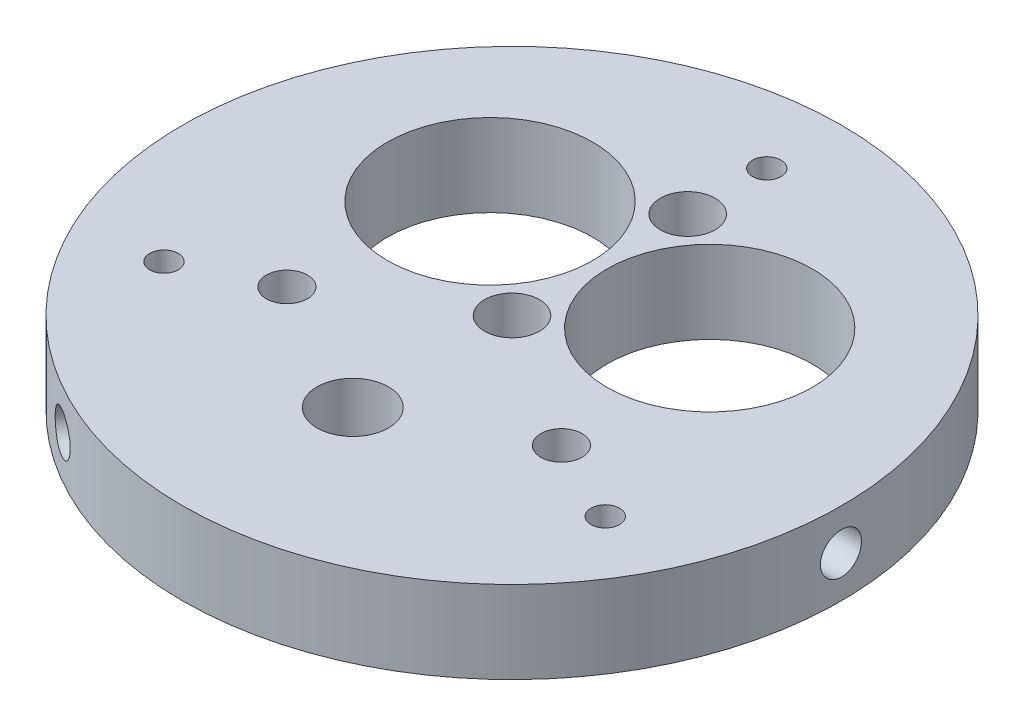
ISO-10303-21;
HEADER;
FILE_DESCRIPTION(('STEP AP214'),'2;1');
FILE_NAME('part.step','',(''),(''),'','','');
FILE_SCHEMA(('AUTOMOTIVE_DESIGN { 1 0 10303 214 1 1 1 1 }'));
ENDSEC;
DATA;
#1=APPLICATION_CONTEXT('core data for automotive mechanical design processes');
#2=APPLICATION_PROTOCOL_DEFINITION('international standard','automotive_design',2000,#1);
#3=PRODUCT_CONTEXT('',#1,'mechanical');
#4=PRODUCT('Part','Part','',(#3));
#5=PRODUCT_RELATED_PRODUCT_CATEGORY('part','',(#4));
#6=PRODUCT_DEFINITION_FORMATION('','',#4);
#7=PRODUCT_DEFINITION_CONTEXT('part definition',#1,'design');
#8=PRODUCT_DEFINITION('design','',#6,#7);
#9=PRODUCT_DEFINITION_SHAPE('','',#8);
#10=(LENGTH_UNIT() NAMED_UNIT(*) SI_UNIT(.MILLI.,.METRE.));
#11=(NAMED_UNIT(*) PLANE_ANGLE_UNIT() SI_UNIT($,.RADIAN.));
#12=(NAMED_UNIT(*) SI_UNIT($,.STERADIAN.) SOLID_ANGLE_UNIT());
#13=UNCERTAINTY_MEASURE_WITH_UNIT(LENGTH_MEASURE(1.E-05),#10,'distance_accuracy_value','');
#14=(GEOMETRIC_REPRESENTATION_CONTEXT(3) GLOBAL_UNCERTAINTY_ASSIGNED_CONTEXT((#13)) GLOBAL_UNIT_ASSIGNED_CONTEXT((#10,
#11,#12)) REPRESENTATION_CONTEXT('',''));
#15=CARTESIAN_POINT('',(0.,0.,0.));
#16=DIRECTION('',(0.,0.,1.));
#17=DIRECTION('',(1.,0.,0.));
#18=AXIS2_PLACEMENT_3D('',#15,#16,#17);
#19=CARTESIAN_POINT('',(0.,9.525,0.));
#20=DIRECTION('',(0.,-1.,0.));
#21=DIRECTION('',(0.,0.,-1.));
#22=AXIS2_PLACEMENT_3D('',#19,#20,#21);
#23=CYLINDRICAL_SURFACE('',#22,38.1127);
#24=CARTESIAN_POINT('',(38.0386349818182,4.7625,-2.37489999999973));
#25=CARTESIAN_POINT('',(38.0386359727121,4.62923983544651,-2.37489413598259));
#26=CARTESIAN_POINT('',(38.0393427848158,4.49588634195096,-2.36364608602858));
#27=CARTESIAN_POINT('',(38.0420939960774,4.23286151976421,-2.31893681664145));
#28=CARTESIAN_POINT('',(38.0441399524101,4.10319466132266,-2.28544973670502));
#29=CARTESIAN_POINT('',(38.0493368106551,3.8513911345155,-2.19722795417698));
#30=CARTESIAN_POINT('',(38.0524871295666,3.72925053290825,-2.14250446081157));
#31=CARTESIAN_POINT('',(38.0595370069414,3.49592055513315,-2.0133813671674));
#32=CARTESIAN_POINT('',(38.0634363936992,3.38472867805543,-1.93898627465461));
#33=CARTESIAN_POINT('',(38.071551633935,3.17625429793563,-1.77250980503899));
#34=CARTESIAN_POINT('',(38.0757678978269,3.07899032452425,-1.68040524181713));
#35=CARTESIAN_POINT('',(38.0840379951772,2.90129127689857,-1.48117213582934));
#36=CARTESIAN_POINT('',(38.0880918218573,2.82085690437185,-1.37404296694357));
#37=CARTESIAN_POINT('',(38.0955837855154,2.67904384677508,-1.1476977190819));
#38=CARTESIAN_POINT('',(38.0990214288969,2.61768040994676,-1.02847206882181));
#39=CARTESIAN_POINT('',(38.1048893709577,2.51584875804747,-0.78138537629629));
#40=CARTESIAN_POINT('',(38.1073196803666,2.47538032041119,-0.653524426027094));
#41=CARTESIAN_POINT('',(38.1108962880296,2.41653860293246,-0.392974407169462));
#42=CARTESIAN_POINT('',(38.1120442657019,2.3981364214773,-0.260291889038112));
#43=CARTESIAN_POINT('',(38.1129325127325,2.38386033661758,0.00628344964127072));
#44=CARTESIAN_POINT('',(38.1126727978782,2.3879861805584,0.140176256598949));
#45=CARTESIAN_POINT('',(38.1107763266553,2.41862518184881,0.405175683019));
#46=CARTESIAN_POINT('',(38.1091414827086,2.44510724809921,0.536285912789693));
#47=CARTESIAN_POINT('',(38.1046810139763,2.51965871909632,0.792196531978301));
#48=CARTESIAN_POINT('',(38.1018553821853,2.56772825084278,0.916996884270202));
#49=CARTESIAN_POINT('',(38.0953281966098,2.68412534410554,1.15684492499113));
#50=CARTESIAN_POINT('',(38.0916260339154,2.75246699667638,1.27188575785861));
#51=CARTESIAN_POINT('',(38.0837624394857,2.90745810824412,1.48887429970503));
#52=CARTESIAN_POINT('',(38.0796010026144,2.99410777198625,1.59082186223663));
#53=CARTESIAN_POINT('',(38.0712788538873,3.18343083884459,1.77891141185151));
#54=CARTESIAN_POINT('',(38.0671181552868,3.28613122789602,1.86502623893997));
#55=CARTESIAN_POINT('',(38.0592736327965,3.50454590614921,2.01879642754742));
#56=CARTESIAN_POINT('',(38.0555898090951,3.62026020049682,2.08645178176728));
#57=CARTESIAN_POINT('',(38.0491150302397,3.86143523082251,2.20138059364549));
#58=CARTESIAN_POINT('',(38.0463241251138,3.98689651241167,2.24865290934261));
#59=CARTESIAN_POINT('',(38.0419517047523,4.24399622181942,2.32145501331087));
#60=CARTESIAN_POINT('',(38.0403701753754,4.37563457738962,2.34698505581749));
#61=CARTESIAN_POINT('',(38.0385975079237,4.64111479483818,2.3755440747802));
#62=CARTESIAN_POINT('',(38.0384040370311,4.77495258056907,2.37861080402032));
#63=CARTESIAN_POINT('',(38.03942321047,5.04124074229214,2.36225478031421));
#64=CARTESIAN_POINT('',(38.0406358475295,5.17369112545608,2.34283214367779));
#65=CARTESIAN_POINT('',(38.0443284492782,5.4333379502686,2.28208008575283));
#66=CARTESIAN_POINT('',(38.0468074081529,5.56053847524434,2.24076804981454));
#67=CARTESIAN_POINT('',(38.0527524387974,5.80620085402902,2.137427501211));
#68=CARTESIAN_POINT('',(38.0562185194656,5.9246626290508,2.07539880179551));
#69=CARTESIAN_POINT('',(38.06375285391,6.14965822912002,1.93228921421749));
#70=CARTESIAN_POINT('',(38.067821904569,6.2561759365946,1.85118302871922));
#71=CARTESIAN_POINT('',(38.0761008425987,6.45409739440115,1.6722575975518));
#72=CARTESIAN_POINT('',(38.0803107313402,6.54550099757474,1.57443818917331));
#73=CARTESIAN_POINT('',(38.0884037679067,6.71072714043947,1.36470057159411));
#74=CARTESIAN_POINT('',(38.0922864569324,6.78452525054199,1.25276309725812));
#75=CARTESIAN_POINT('',(38.0992809941233,6.91227837888538,1.01806373839066));
#76=CARTESIAN_POINT('',(38.1023928470198,6.96623351892175,0.895301920304408));
#77=CARTESIAN_POINT('',(38.107492882471,7.0527266237693,0.642528462239904));
#78=CARTESIAN_POINT('',(38.1094818762282,7.08528005291724,0.512522130811753));
#79=CARTESIAN_POINT('',(38.1121153105127,7.12809627337091,0.248876229516098));
#80=CARTESIAN_POINT('',(38.1127597641746,7.13835928242649,0.115236695153409));
#81=CARTESIAN_POINT('',(38.1126315433756,7.13630121823691,-0.151640248575062));
#82=CARTESIAN_POINT('',(38.1118612680722,7.12401837921867,-0.284877955629739));
#83=CARTESIAN_POINT('',(38.1089949751808,7.07729655177778,-0.547395260411214));
#84=CARTESIAN_POINT('',(38.1068989552589,7.04285752435006,-0.676674851169488));
#85=CARTESIAN_POINT('',(38.1016167695244,6.95280952372205,-0.927611963984363));
#86=CARTESIAN_POINT('',(38.0984306111483,6.89720069493609,-1.04926953802959));
#87=CARTESIAN_POINT('',(38.091325890751,6.76639697704173,-1.28152632379672));
#88=CARTESIAN_POINT('',(38.0874073477859,6.69120259751733,-1.39212582312806));
#89=CARTESIAN_POINT('',(38.0792707506348,6.5232211222031,-1.59932076727468));
#90=CARTESIAN_POINT('',(38.0750522329968,6.43040641723475,-1.69589380925071));
#91=CARTESIAN_POINT('',(38.0667948161314,6.22985544097584,-1.87212148221923));
#92=CARTESIAN_POINT('',(38.0627559611195,6.12211552310079,-1.95177196654192));
#93=CARTESIAN_POINT('',(38.0553095701463,5.89464993528759,-2.09195218160562));
#94=CARTESIAN_POINT('',(38.0519028209761,5.77490960987748,-2.152458148057));
#95=CARTESIAN_POINT('',(38.046116464948,5.52703554963833,-2.25243299813299));
#96=CARTESIAN_POINT('',(38.0437356555167,5.39891184565561,-2.2919265246793));
#97=CARTESIAN_POINT('',(38.0408947877392,5.18542007143343,-2.33848911309042));
#98=CARTESIAN_POINT('',(38.0400511465564,5.10143206263123,-2.35212554278849));
#99=CARTESIAN_POINT('',(38.0389209279353,4.93247536067762,-2.37033285030469));
#100=CARTESIAN_POINT('',(38.0386343497269,4.84750666888227,-2.3749037406567));
#101=CARTESIAN_POINT('',(38.0386349818182,4.7625,-2.37489999999973));
#102=B_SPLINE_CURVE_WITH_KNOTS('',3,(#24,#25,#26,#27,#28,#29,#30,#31,#32,#33,#34,#35,#36,#37,
#38,#39,#40,#41,#42,#43,#44,#45,#46,#47,#48,#49,#50,#51,#52,#53,#54,#55,#56,#57,#58,#59,#60,#61,
#62,#63,#64,#65,#66,#67,#68,#69,#70,#71,#72,#73,#74,#75,#76,#77,#78,#79,#80,#81,#82,#83,#84,#85,
#86,#87,#88,#89,#90,#91,#92,#93,#94,#95,#96,#97,#98,#99,#100,#101),.UNSPECIFIED.,.T.,.F.,(4,2,2,
2,2,2,2,2,2,2,2,2,2,2,2,2,2,2,2,2,2,2,2,2,2,2,2,2,2,2,2,2,2,2,2,2,2,2,4),(0.,0.399470166575745,
0.79940566956956,1.19913036091437,1.59876353422035,1.99892353439712,2.39910021538456,
2.79959604090948,3.20008760042222,3.60005403509275,4.0000159840989,4.3994226152202,
4.79883159609414,5.19851885742417,5.59821058884018,5.99858169444916,6.39895295837009,
6.7993466502068,7.19973566011932,7.59945160478513,7.99916548222124,8.39856236730939,
8.79796285285544,9.19789597157583,9.59783298401314,9.99832176716475,10.3988080920882,
10.7990047167025,11.1991974318728,11.5987121097933,11.9982274910451,12.3977401469663,
12.7972424092598,13.1973758943832,13.597607314624,13.9983336147515,14.3985889102477,
14.653411311538,14.9082333605144),.UNSPECIFIED.);
#103=CARTESIAN_POINT('',(38.0386349818182,4.7625,-2.37489999999973));
#104=VERTEX_POINT('',#103);
#105=EDGE_CURVE('E133',#104,#104,#102,.T.);
#106=ORIENTED_EDGE('',*,*,#105,.T.);
#107=EDGE_LOOP('',(#106));
#108=FACE_BOUND('',#107,.T.);
#109=CARTESIAN_POINT('',(-16.9625937594618,4.7625,34.1298742195377));
#110=CARTESIAN_POINT('',(-16.9625993332966,4.62923983544651,34.1298721456685));
#111=CARTESIAN_POINT('',(-16.9726938363516,4.49588634195096,34.124860237929));
#112=CARTESIAN_POINT('',(-17.0127888050564,4.23286151976421,34.1048882220792));
#113=CARTESIAN_POINT('',(-17.0428124451462,4.10319466132266,34.0899165322701));
#114=CARTESIAN_POINT('',(-17.1218131791051,3.8513911345155,34.0503062522661));
#115=CARTESIAN_POINT('',(-17.1707802739992,3.72925053290825,34.0256727617908));
#116=CARTESIAN_POINT('',(-17.2861290919977,3.49592055513315,33.9672165878688));
#117=CARTESIAN_POINT('',(-17.3525068254095,3.38472867805543,33.9333960096039));
#118=CARTESIAN_POINT('',(-17.5007372973469,3.17625429793563,33.8571857789981));
#119=CARTESIAN_POINT('',(-17.5826103208474,3.07899032452426,33.8147848890266));
#120=CARTESIAN_POINT('',(-17.7592863005829,2.90129127689857,33.7223304504298));
#121=CARTESIAN_POINT('',(-17.8540897956643,2.82085690437185,33.6722765828744));
#122=CARTESIAN_POINT('',(-18.0538565121675,2.67904384677508,33.5655921897957));
#123=CARTESIAN_POINT('',(-18.1588277757662,2.61768040994676,33.5089564511633));
#124=CARTESIAN_POINT('',(-18.3757450994607,2.51584875804747,33.390494891793));
#125=CARTESIAN_POINT('',(-18.4876910852503,2.47538032041119,33.3286691263456));
#126=CARTESIAN_POINT('',(-18.7151223243691,2.41653860293246,33.2014915500123));
#127=CARTESIAN_POINT('',(-18.8306027445451,2.3981364214773,33.1361444687739));
#128=CARTESIAN_POINT('',(-19.0619078833791,2.38386033661758,33.0036260439275));
#129=CARTESIAN_POINT('',(-19.1777325981613,2.3879861805584,32.9364547207871));
#130=CARTESIAN_POINT('',(-19.4062805978179,2.41862518184881,32.8023126153204));
#131=CARTESIAN_POINT('',(-19.519007965522,2.44510724809921,32.7353416840461));
#132=CARTESIAN_POINT('',(-19.7384028284715,2.51965871909632,32.6035234952168));
#133=CARTESIAN_POINT('',(-19.845070288062,2.56772825084278,32.5386762501581));
#134=CARTESIAN_POINT('',(-20.0495211915865,2.68412534410554,32.4130995212741));
#135=CARTESIAN_POINT('',(-20.147298393975,2.75246699667637,32.352372937898));
#136=CARTESIAN_POINT('',(-20.3312841863293,2.90745810824412,32.2370685944336));
#137=CARTESIAN_POINT('',(-20.4174926468999,2.99410777198625,32.182490903121));
#138=CARTESIAN_POINT('',(-20.5762219006893,3.18343083884459,32.0812389361019));
#139=CARTESIAN_POINT('',(-20.6487191792901,3.28613122789602,32.0345782518721));
#140=CARTESIAN_POINT('',(-20.7779658077237,3.50454590614921,31.9508996018112));
#141=CARTESIAN_POINT('',(-20.8347151513295,3.62026020049682,31.9138816397928));
#142=CARTESIAN_POINT('',(-20.9310090326151,3.86143523082251,31.8508099108811));
#143=CARTESIAN_POINT('',(-20.9705526063415,3.98689651241167,31.8247567582939));
#144=CARTESIAN_POINT('',(-21.0314148676463,4.24399622181942,31.7845690792007));
#145=CARTESIAN_POINT('',(-21.0527337683282,4.37563457738962,31.7704344133301));
#146=CARTESIAN_POINT('',(-21.0765802705313,4.64111479483818,31.7546197288032));
#147=CARTESIAN_POINT('',(-21.0791394005134,4.77495258056907,31.7529188134752));
#148=CARTESIAN_POINT('',(-21.0654842551985,5.04124074229214,31.7619794554172));
#149=CARTESIAN_POINT('',(-21.0492700769926,5.17369112545608,31.7727409482346));
#150=CARTESIAN_POINT('',(-20.9985035523718,5.4333379502686,31.8063148641175));
#151=CARTESIAN_POINT('',(-20.9639657592045,5.56053847524434,31.829117723447));
#152=CARTESIAN_POINT('',(-20.8774427341951,5.80620085402902,31.8859365453132));
#153=CARTESIAN_POINT('',(-20.8254573450717,5.9246626290508,31.9199526089312));
#154=CARTESIAN_POINT('',(-20.7052879739262,6.14965822912002,31.9980323277497));
#155=CARTESIAN_POINT('',(-20.6370824822101,6.25617593659461,32.0421093217388));
#156=CARTESIAN_POINT('',(-20.4862679824509,6.45409739440115,32.1387418079726));
#157=CARTESIAN_POINT('',(-20.4036588341827,6.54550099757474,32.1912973827591));
#158=CARTESIAN_POINT('',(-20.2260672475132,6.71072714043947,32.303174966809));
#159=CARTESIAN_POINT('',(-20.1310678956156,6.784525250542,32.3625062113082));
#160=CARTESIAN_POINT('',(-19.9313095571798,6.91227837888538,32.485913337637));
#161=CARTESIAN_POINT('',(-19.8265506305506,6.96623351892175,32.5499891903413));
#162=CARTESIAN_POINT('',(-19.6101924121899,7.05272662376929,32.6807926796345));
#163=CARTESIAN_POINT('',(-19.498598123399,7.08528005291724,32.7475183644703));
#164=CARTESIAN_POINT('',(-19.2715907924156,7.12809627337091,32.8816219361078));
#165=CARTESIAN_POINT('',(-19.1561777875385,7.13835928242649,32.9489998165318));
#166=CARTESIAN_POINT('',(-18.9249914641858,7.13630121823691,33.0823272459268));
#167=CARTESIAN_POINT('',(-18.8092190874827,7.12401837921867,33.1482790214735));
#168=CARTESIAN_POINT('',(-18.5804392861633,7.07729655177778,33.2770553914056));
#169=CARTESIAN_POINT('',(-18.4674318664148,7.04285752435006,33.3398799802855));
#170=CARTESIAN_POINT('',(-18.2474728590975,6.95280952372205,33.4607740296594));
#171=CARTESIAN_POINT('',(-18.1405212302235,6.89720069493608,33.5188435225879));
#172=CARTESIAN_POINT('',(-17.9358285933492,6.76639697704172,33.6288190471206));
#173=CARTESIAN_POINT('',(-17.8380873457999,6.69120259751733,33.6807252390326));
#174=CARTESIAN_POINT('',(-17.6545829620577,6.5232211222031,33.7772762112727));
#175=CARTESIAN_POINT('',(-17.5688389955667,6.43040641723475,33.8219093888199));
#176=CARTESIAN_POINT('',(-17.4120926454934,6.22985544097584,33.9028720925291));
#177=CARTESIAN_POINT('',(-17.3410938751403,6.12211552310079,33.9391995836479));
#178=CARTESIAN_POINT('',(-17.2159710523006,5.89464993528759,34.0028409274305));
#179=CARTESIAN_POINT('',(-17.1618679736881,5.77490960987748,34.0301435793305));
#180=CARTESIAN_POINT('',(-17.0723940357686,5.52703554963833,34.0751198730528));
#181=CARTESIAN_POINT('',(-17.0370012337788,5.39891184565561,34.0928047948768));
#182=CARTESIAN_POINT('',(-16.9952564154601,5.18542007143343,34.1136258254183));
#183=CARTESIAN_POINT('',(-16.9830251003332,5.10143206263123,34.1197134255713));
#184=CARTESIAN_POINT('',(-16.9666920001792,4.93247536067762,34.1278382812918));
#185=CARTESIAN_POINT('',(-16.9625902039122,4.84750666888227,34.1298755424591));
#186=CARTESIAN_POINT('',(-16.9625937594618,4.7625,34.1298742195377));
#187=B_SPLINE_CURVE_WITH_KNOTS('',3,(#109,#110,#111,#112,#113,#114,#115,#116,#117,#118,#119,
#120,#121,#122,#123,#124,#125,#126,#127,#128,#129,#130,#131,#132,#133,#134,#135,#136,#137,#138,
#139,#140,#141,#142,#143,#144,#145,#146,#147,#148,#149,#150,#151,#152,#153,#154,#155,#156,#157,
#158,#159,#160,#161,#162,#163,#164,#165,#166,#167,#168,#169,#170,#171,#172,#173,#174,#175,#176,
#177,#178,#179,#180,#181,#182,#183,#184,#185,#186),.UNSPECIFIED.,.T.,.F.,(4,2,2,2,2,2,2,2,2,2,2,
2,2,2,2,2,2,2,2,2,2,2,2,2,2,2,2,2,2,2,2,2,2,2,2,2,2,2,4),(0.,0.399470166575744,
0.799405669569559,1.19913036091437,1.59876353422035,1.99892353439712,2.39910021538456,
2.79959604090948,3.20008760042222,3.60005403509276,4.00001598409889,4.39942261522021,
4.79883159609414,5.19851885742417,5.59821058884018,5.99858169444916,6.39895295837009,
6.7993466502068,7.19973566011932,7.59945160478513,7.99916548222124,8.39856236730939,
8.79796285285544,9.19789597157583,9.59783298401314,9.99832176716475,10.3988080920882,
10.7990047167025,11.1991974318728,11.5987121097933,11.9982274910451,12.3977401469663,
12.7972424092598,13.1973758943832,13.597607314624,13.9983336147515,14.3985889102477,
14.653411311538,14.9082333605144),.UNSPECIFIED.);
#188=CARTESIAN_POINT('',(-16.9625937594618,4.7625,34.1298742195377));
#189=VERTEX_POINT('',#188);
#190=EDGE_CURVE('E134',#189,#189,#187,.T.);
#191=ORIENTED_EDGE('',*,*,#190,.T.);
#192=EDGE_LOOP('',(#191));
#193=FACE_BOUND('',#192,.T.);
#194=CARTESIAN_POINT('',(-21.0760412223567,4.7625,-31.754974219538));
#195=CARTESIAN_POINT('',(-21.0760366394158,4.62923983544651,-31.7549780096859));
#196=CARTESIAN_POINT('',(-21.0666489484644,4.49588634195096,-31.7612141519004));
#197=CARTESIAN_POINT('',(-21.0293051910214,4.23286151976421,-31.7859514054377));
#198=CARTESIAN_POINT('',(-21.0013275072642,4.10319466132266,-31.804466795565));
#199=CARTESIAN_POINT('',(-20.9275236315503,3.8513911345155,-31.8530782980891));
#200=CARTESIAN_POINT('',(-20.8817068555677,3.72925053290825,-31.8831683009792));
#201=CARTESIAN_POINT('',(-20.7734079149441,3.49592055513315,-31.9538352207014));
#202=CARTESIAN_POINT('',(-20.71092956829,3.38472867805543,-31.9944097349493));
#203=CARTESIAN_POINT('',(-20.5708143365884,3.17625429793563,-32.0846759739591));
#204=CARTESIAN_POINT('',(-20.4931575769798,3.07899032452426,-32.1343796472095));
#205=CARTESIAN_POINT('',(-20.3247516945946,2.90129127689857,-32.2411583146005));
#206=CARTESIAN_POINT('',(-20.2340020261933,2.82085690437186,-32.2982336159309));
#207=CARTESIAN_POINT('',(-20.0417272733482,2.67904384677508,-32.4178944707138));
#208=CARTESIAN_POINT('',(-19.940193653131,2.61768040994676,-32.4804843823414));
#209=CARTESIAN_POINT('',(-19.7291442714972,2.51584875804748,-32.6091095154967));
#210=CARTESIAN_POINT('',(-19.6196285951165,2.47538032041119,-32.6751447003185));
#211=CARTESIAN_POINT('',(-19.3957739636608,2.41653860293246,-32.8085171428429));
#212=CARTESIAN_POINT('',(-19.2814415211572,2.3981364214773,-32.8758525797357));
#213=CARTESIAN_POINT('',(-19.0510246293537,2.38386033661758,-33.0099094935687));
#214=CARTESIAN_POINT('',(-18.9349401997172,2.3879861805584,-33.076630977386));
#215=CARTESIAN_POINT('',(-18.7044957288376,2.41862518184881,-33.2074882983395));
#216=CARTESIAN_POINT('',(-18.5901335171868,2.44510724809921,-33.2716275968358));
#217=CARTESIAN_POINT('',(-18.3662781855052,2.51965871909632,-33.3957200271951));
#218=CARTESIAN_POINT('',(-18.2567850941236,2.56772825084278,-33.4556731344283));
#219=CARTESIAN_POINT('',(-18.0458070050237,2.68412534410554,-33.5699444462652));
#220=CARTESIAN_POINT('',(-17.9443276399407,2.75246699667638,-33.6242586957566));
#221=CARTESIAN_POINT('',(-17.7524782531567,2.90745810824413,-33.7259428941386));
#222=CARTESIAN_POINT('',(-17.6621083557147,2.99410777198625,-33.7733127653577));
#223=CARTESIAN_POINT('',(-17.4950569531984,3.18343083884459,-33.8601503479534));
#224=CARTESIAN_POINT('',(-17.418398975997,3.28613122789602,-33.8996044908121));
#225=CARTESIAN_POINT('',(-17.2813078250731,3.50454590614921,-33.9696960293586));
#226=CARTESIAN_POINT('',(-17.2208746577659,3.62026020049682,-34.0003334215601));
#227=CARTESIAN_POINT('',(-17.118105997625,3.86143523082251,-34.0521905045266));
#228=CARTESIAN_POINT('',(-17.0757715187726,3.98689651241167,-34.0734096676365));
#229=CARTESIAN_POINT('',(-17.0105368371064,4.24399622181942,-34.1060240925116));
#230=CARTESIAN_POINT('',(-16.9876364070475,4.37563457738962,-34.1174194691476));
#231=CARTESIAN_POINT('',(-16.9620172373928,4.64111479483818,-34.1301638035834));
#232=CARTESIAN_POINT('',(-16.959264636518,4.77495258056907,-34.1315296174955));
#233=CARTESIAN_POINT('',(-16.9739389552718,5.04124074229214,-34.1242342357314));
#234=CARTESIAN_POINT('',(-16.9913657705372,5.17369112545608,-34.1155730919124));
#235=CARTESIAN_POINT('',(-17.0458248969067,5.4333379502686,-34.0883949498703));
#236=CARTESIAN_POINT('',(-17.0828416489487,5.56053847524434,-34.0698857732615));
#237=CARTESIAN_POINT('',(-17.1753097046026,5.80620085402902,-34.0233640465242));
#238=CARTESIAN_POINT('',(-17.2307611743943,5.9246626290508,-33.9953514107267));
#239=CARTESIAN_POINT('',(-17.3584648799842,6.14965822912002,-33.9303215419672));
#240=CARTESIAN_POINT('',(-17.4307394223592,6.2561759365946,-33.893292350458));
#241=CARTESIAN_POINT('',(-17.5898328601481,6.45409739440115,-33.8109994055244));
#242=CARTESIAN_POINT('',(-17.6766518971578,6.54550099757474,-33.7657355719324));
#243=CARTESIAN_POINT('',(-17.8623365203939,6.71072714043947,-33.6678755384031));
#244=CARTESIAN_POINT('',(-17.9612185613172,6.78452525054199,-33.6152693085664));
#245=CARTESIAN_POINT('',(-18.1679714369437,6.91227837888538,-33.5039770760276));
#246=CARTESIAN_POINT('',(-18.2758422164694,6.96623351892175,-33.4452911106457));
#247=CARTESIAN_POINT('',(-18.4973004702813,7.0527266237693,-33.3233211418744));
#248=CARTESIAN_POINT('',(-18.6108837528295,7.08528005291724,-33.2600404952821));
#249=CARTESIAN_POINT('',(-18.8405245180975,7.12809627337091,-33.1304981656238));
#250=CARTESIAN_POINT('',(-18.9565819766364,7.13835928242649,-33.0642365116852));
#251=CARTESIAN_POINT('',(-19.1876400791901,7.13630121823691,-32.9306869973518));
#252=CARTESIAN_POINT('',(-19.3026421805898,7.12401837921867,-32.8634010658438));
#253=CARTESIAN_POINT('',(-19.5285556890179,7.07729655177778,-32.7296601309944));
#254=CARTESIAN_POINT('',(-19.6394670888444,7.04285752435006,-32.6632051291161));
#255=CARTESIAN_POINT('',(-19.8541439104272,6.95280952372205,-32.533162065675));
#256=CARTESIAN_POINT('',(-19.9579093809251,6.89720069493609,-32.4695739845583));
#257=CARTESIAN_POINT('',(-20.1554972974021,6.76639697704173,-32.3472927233238));
#258=CARTESIAN_POINT('',(-20.2493200019863,6.69120259751733,-32.2885994159045));
#259=CARTESIAN_POINT('',(-20.4246877885775,6.5232211222031,-32.177955443998));
#260=CARTESIAN_POINT('',(-20.5062132374304,6.43040641723475,-32.1260155795692));
#261=CARTESIAN_POINT('',(-20.6547021706383,6.22985544097584,-32.0307506103099));
#262=CARTESIAN_POINT('',(-20.7216620859795,6.12211552310079,-31.987427617106));
#263=CARTESIAN_POINT('',(-20.839338517846,5.89464993528759,-31.9108887458249));
#264=CARTESIAN_POINT('',(-20.8900348472884,5.77490960987748,-31.8776854312735));
#265=CARTESIAN_POINT('',(-20.9737224291797,5.52703554963833,-31.8226868749198));
#266=CARTESIAN_POINT('',(-21.0067344217381,5.39891184565561,-31.8008782701975));
#267=CARTESIAN_POINT('',(-21.0456383722794,5.18542007143343,-31.7751367123279));
#268=CARTESIAN_POINT('',(-21.0570260462234,5.10143206263123,-31.7675878827828));
#269=CARTESIAN_POINT('',(-21.0722289277564,4.93247536067762,-31.757505430987));
#270=CARTESIAN_POINT('',(-21.076044145815,4.84750666888227,-31.7549718018024));
#271=CARTESIAN_POINT('',(-21.0760412223567,4.7625,-31.754974219538));
#272=B_SPLINE_CURVE_WITH_KNOTS('',3,(#194,#195,#196,#197,#198,#199,#200,#201,#202,#203,#204,
#205,#206,#207,#208,#209,#210,#211,#212,#213,#214,#215,#216,#217,#218,#219,#220,#221,#222,#223,
#224,#225,#226,#227,#228,#229,#230,#231,#232,#233,#234,#235,#236,#237,#238,#239,#240,#241,#242,
#243,#244,#245,#246,#247,#248,#249,#250,#251,#252,#253,#254,#255,#256,#257,#258,#259,#260,#261,
#262,#263,#264,#265,#266,#267,#268,#269,#270,#271),.UNSPECIFIED.,.T.,.F.,(4,2,2,2,2,2,2,2,2,2,2,
2,2,2,2,2,2,2,2,2,2,2,2,2,2,2,2,2,2,2,2,2,2,2,2,2,2,2,4),(0.,0.399470166575746,
0.799405669569559,1.19913036091437,1.59876353422035,1.99892353439712,2.39910021538456,
2.79959604090947,3.20008760042221,3.60005403509275,4.00001598409889,4.3994226152202,
4.79883159609414,5.19851885742417,5.59821058884018,5.99858169444916,6.39895295837009,
6.7993466502068,7.19973566011932,7.59945160478513,7.99916548222124,8.39856236730939,
8.79796285285544,9.19789597157583,9.59783298401314,9.99832176716475,10.3988080920882,
10.7990047167025,11.1991974318728,11.5987121097933,11.9982274910451,12.3977401469663,
12.7972424092598,13.1973758943832,13.597607314624,13.9983336147515,14.3985889102477,
14.6534113115381,14.9082333605144),.UNSPECIFIED.);
#273=CARTESIAN_POINT('',(-21.0760412223567,4.7625,-31.754974219538));
#274=VERTEX_POINT('',#273);
#275=EDGE_CURVE('E11',#274,#274,#272,.T.);
#276=ORIENTED_EDGE('',*,*,#275,.T.);
#277=EDGE_LOOP('',(#276));
#278=FACE_BOUND('',#277,.T.);
#279=CARTESIAN_POINT('',(0.,9.525,0.));
#280=DIRECTION('',(0.,1.,0.));
#281=DIRECTION('',(0.,0.,1.));
#282=AXIS2_PLACEMENT_3D('',#279,#280,#281);
#283=CIRCLE('',#282,38.1127);
#284=CARTESIAN_POINT('',(0.,9.525,38.1127));
#285=VERTEX_POINT('',#284);
#286=EDGE_CURVE('E68',#285,#285,#283,.T.);
#287=ORIENTED_EDGE('',*,*,#286,.F.);
#288=EDGE_LOOP('',(#287));
#289=FACE_BOUND('',#288,.T.);
#290=CARTESIAN_POINT('',(0.,0.,0.));
#291=DIRECTION('',(0.,1.,0.));
#292=DIRECTION('',(0.,0.,1.));
#293=AXIS2_PLACEMENT_3D('',#290,#291,#292);
#294=CIRCLE('',#293,38.1127);
#295=CARTESIAN_POINT('',(0.,0.,38.1127));
#296=VERTEX_POINT('',#295);
#297=EDGE_CURVE('E72',#296,#296,#294,.T.);
#298=ORIENTED_EDGE('',*,*,#297,.T.);
#299=EDGE_LOOP('',(#298));
#300=FACE_BOUND('',#299,.T.);
#301=ADVANCED_FACE('F57',(#108,#193,#278,#289,#300),#23,.T.);
#302=CARTESIAN_POINT('',(0.,9.525,0.));
#303=DIRECTION('',(0.,1.,0.));
#304=DIRECTION('',(0.,0.,1.));
#305=AXIS2_PLACEMENT_3D('',#302,#303,#304);
#306=PLANE('',#305);
#307=CARTESIAN_POINT('',(-15.875,9.525,10.16));
#308=DIRECTION('',(0.,1.,0.));
#309=DIRECTION('',(0.,0.,1.));
#310=AXIS2_PLACEMENT_3D('',#307,#308,#309);
#311=CIRCLE('',#310,2.38125);
#312=CARTESIAN_POINT('',(-15.875,9.525,12.54125));
#313=VERTEX_POINT('',#312);
#314=EDGE_CURVE('E172',#313,#313,#311,.T.);
#315=ORIENTED_EDGE('',*,*,#314,.F.);
#316=EDGE_LOOP('',(#315));
#317=FACE_BOUND('',#316,.T.);
#318=CARTESIAN_POINT('',(15.875,9.525,10.16));
#319=DIRECTION('',(0.,1.,0.));
#320=DIRECTION('',(0.,0.,1.));
#321=AXIS2_PLACEMENT_3D('',#318,#319,#320);
#322=CIRCLE('',#321,2.38125);
#323=CARTESIAN_POINT('',(15.875,9.525,12.54125));
#324=VERTEX_POINT('',#323);
#325=EDGE_CURVE('E166',#324,#324,#322,.T.);
#326=ORIENTED_EDGE('',*,*,#325,.F.);
#327=EDGE_LOOP('',(#326));
#328=FACE_BOUND('',#327,.T.);
#329=CARTESIAN_POINT('',(0.,9.525,-29.464));
#330=DIRECTION('',(0.,1.,0.));
#331=DIRECTION('',(0.,0.,1.));
#332=AXIS2_PLACEMENT_3D('',#329,#330,#331);
#333=CIRCLE('',#332,1.651);
#334=CARTESIAN_POINT('',(0.,9.525,-27.813));
#335=VERTEX_POINT('',#334);
#336=EDGE_CURVE('E92',#335,#335,#333,.T.);
#337=ORIENTED_EDGE('',*,*,#336,.F.);
#338=EDGE_LOOP('',(#337));
#339=FACE_BOUND('',#338,.T.);
#340=CARTESIAN_POINT('',(0.,9.525,-20.32));
#341=DIRECTION('',(0.,1.,0.));
#342=DIRECTION('',(0.,0.,1.));
#343=AXIS2_PLACEMENT_3D('',#340,#341,#342);
#344=CIRCLE('',#343,3.175);
#345=CARTESIAN_POINT('',(0.,9.525,-17.145));
#346=VERTEX_POINT('',#345);
#347=EDGE_CURVE('E111',#346,#346,#344,.T.);
#348=ORIENTED_EDGE('',*,*,#347,.F.);
#349=EDGE_LOOP('',(#348));
#350=FACE_BOUND('',#349,.T.);
#351=CARTESIAN_POINT('',(12.7,9.525,-10.16));
#352=DIRECTION('',(0.,1.,0.));
#353=DIRECTION('',(0.,0.,1.));
#354=AXIS2_PLACEMENT_3D('',#351,#352,#353);
#355=CIRCLE('',#354,11.8745);
#356=CARTESIAN_POINT('',(12.7,9.525,1.7145));
#357=VERTEX_POINT('',#356);
#358=EDGE_CURVE('E105',#357,#357,#355,.T.);
#359=ORIENTED_EDGE('',*,*,#358,.F.);
#360=EDGE_LOOP('',(#359));
#361=FACE_BOUND('',#360,.T.);
#362=CARTESIAN_POINT('',(0.,9.525,0.));
#363=DIRECTION('',(0.,1.,0.));
#364=DIRECTION('',(0.,0.,1.));
#365=AXIS2_PLACEMENT_3D('',#362,#363,#364);
#366=CIRCLE('',#365,3.175);
#367=CARTESIAN_POINT('',(0.,9.525,3.175));
#368=VERTEX_POINT('',#367);
#369=EDGE_CURVE('E117',#368,#368,#366,.T.);
#370=ORIENTED_EDGE('',*,*,#369,.F.);
#371=EDGE_LOOP('',(#370));
#372=FACE_BOUND('',#371,.T.);
#373=CARTESIAN_POINT('',(-25.5165724971028,9.525,14.7320000000011));
#374=DIRECTION('',(0.,1.,0.));
#375=DIRECTION('',(0.,0.,1.));
#376=AXIS2_PLACEMENT_3D('',#373,#374,#375);
#377=CIRCLE('',#376,1.651);
#378=CARTESIAN_POINT('',(-25.5165724971028,9.525,16.3830000000011));
#379=VERTEX_POINT('',#378);
#380=EDGE_CURVE('E86',#379,#379,#377,.T.);
#381=ORIENTED_EDGE('',*,*,#380,.F.);
#382=EDGE_LOOP('',(#381));
#383=FACE_BOUND('',#382,.T.);
#384=CARTESIAN_POINT('',(25.5165724971066,9.525,14.7319999999989));
#385=DIRECTION('',(0.,1.,0.));
#386=DIRECTION('',(0.,0.,1.));
#387=AXIS2_PLACEMENT_3D('',#384,#385,#386);
#388=CIRCLE('',#387,1.651);
#389=CARTESIAN_POINT('',(25.5165724971066,9.525,16.3829999999989));
#390=VERTEX_POINT('',#389);
#391=EDGE_CURVE('E79',#390,#390,#388,.T.);
#392=ORIENTED_EDGE('',*,*,#391,.F.);
#393=EDGE_LOOP('',(#392));
#394=FACE_BOUND('',#393,.T.);
#395=CARTESIAN_POINT('',(0.,9.525,18.415));
#396=DIRECTION('',(0.,1.,0.));
#397=DIRECTION('',(0.,0.,1.));
#398=AXIS2_PLACEMENT_3D('',#395,#396,#397);
#399=CIRCLE('',#398,4.1275);
#400=CARTESIAN_POINT('',(0.,9.525,22.5425));
#401=VERTEX_POINT('',#400);
#402=EDGE_CURVE('E100',#401,#401,#399,.T.);
#403=ORIENTED_EDGE('',*,*,#402,.F.);
#404=EDGE_LOOP('',(#403));
#405=FACE_BOUND('',#404,.T.);
#406=CARTESIAN_POINT('',(-12.7,9.525,-10.16));
#407=DIRECTION('',(0.,1.,0.));
#408=DIRECTION('',(0.,0.,1.));
#409=AXIS2_PLACEMENT_3D('',#406,#407,#408);
#410=CIRCLE('',#409,11.8745);
#411=CARTESIAN_POINT('',(-12.7,9.525,1.7145));
#412=VERTEX_POINT('',#411);
#413=EDGE_CURVE('E93',#412,#412,#410,.T.);
#414=ORIENTED_EDGE('',*,*,#413,.F.);
#415=EDGE_LOOP('',(#414));
#416=FACE_BOUND('',#415,.T.);
#417=ORIENTED_EDGE('',*,*,#286,.T.);
#418=EDGE_LOOP('',(#417));
#419=FACE_BOUND('',#418,.T.);
#420=ADVANCED_FACE('F188',(#317,#328,#339,#350,#361,#372,#383,#394,#405,#416,#419),#306,.T.);
#421=CARTESIAN_POINT('',(0.,0.,0.));
#422=DIRECTION('',(0.,1.,0.));
#423=DIRECTION('',(0.,0.,1.));
#424=AXIS2_PLACEMENT_3D('',#421,#422,#423);
#425=PLANE('',#424);
#426=CARTESIAN_POINT('',(-15.875,0.,10.16));
#427=DIRECTION('',(0.,1.,0.));
#428=DIRECTION('',(0.,0.,1.));
#429=AXIS2_PLACEMENT_3D('',#426,#427,#428);
#430=CIRCLE('',#429,2.38125);
#431=CARTESIAN_POINT('',(-15.875,0.,12.54125));
#432=VERTEX_POINT('',#431);
#433=EDGE_CURVE('E142',#432,#432,#430,.T.);
#434=ORIENTED_EDGE('',*,*,#433,.T.);
#435=EDGE_LOOP('',(#434));
#436=FACE_BOUND('',#435,.T.);
#437=CARTESIAN_POINT('',(15.875,0.,10.16));
#438=DIRECTION('',(0.,1.,0.));
#439=DIRECTION('',(0.,0.,1.));
#440=AXIS2_PLACEMENT_3D('',#437,#438,#439);
#441=CIRCLE('',#440,2.38125);
#442=CARTESIAN_POINT('',(15.875,0.,12.54125));
#443=VERTEX_POINT('',#442);
#444=EDGE_CURVE('E169',#443,#443,#441,.T.);
#445=ORIENTED_EDGE('',*,*,#444,.T.);
#446=EDGE_LOOP('',(#445));
#447=FACE_BOUND('',#446,.T.);
#448=CARTESIAN_POINT('',(0.,0.,-29.464));
#449=DIRECTION('',(0.,1.,0.));
#450=DIRECTION('',(0.,0.,1.));
#451=AXIS2_PLACEMENT_3D('',#448,#449,#450);
#452=CIRCLE('',#451,1.651);
#453=CARTESIAN_POINT('',(0.,0.,-27.813));
#454=VERTEX_POINT('',#453);
#455=EDGE_CURVE('E77',#454,#454,#452,.T.);
#456=ORIENTED_EDGE('',*,*,#455,.T.);
#457=EDGE_LOOP('',(#456));
#458=FACE_BOUND('',#457,.T.);
#459=CARTESIAN_POINT('',(0.,0.,-20.32));
#460=DIRECTION('',(0.,1.,0.));
#461=DIRECTION('',(0.,0.,1.));
#462=AXIS2_PLACEMENT_3D('',#459,#460,#461);
#463=CIRCLE('',#462,3.175);
#464=CARTESIAN_POINT('',(0.,0.,-17.145));
#465=VERTEX_POINT('',#464);
#466=EDGE_CURVE('E108',#465,#465,#463,.T.);
#467=ORIENTED_EDGE('',*,*,#466,.T.);
#468=EDGE_LOOP('',(#467));
#469=FACE_BOUND('',#468,.T.);
#470=CARTESIAN_POINT('',(12.7,0.,-10.16));
#471=DIRECTION('',(0.,1.,0.));
#472=DIRECTION('',(0.,0.,1.));
#473=AXIS2_PLACEMENT_3D('',#470,#471,#472);
#474=CIRCLE('',#473,11.8745);
#475=CARTESIAN_POINT('',(12.7,0.,1.7145));
#476=VERTEX_POINT('',#475);
#477=EDGE_CURVE('E97',#476,#476,#474,.T.);
#478=ORIENTED_EDGE('',*,*,#477,.T.);
#479=EDGE_LOOP('',(#478));
#480=FACE_BOUND('',#479,.T.);
#481=CARTESIAN_POINT('',(0.,0.,0.));
#482=DIRECTION('',(0.,1.,0.));
#483=DIRECTION('',(0.,0.,1.));
#484=AXIS2_PLACEMENT_3D('',#481,#482,#483);
#485=CIRCLE('',#484,3.175);
#486=CARTESIAN_POINT('',(0.,0.,3.175));
#487=VERTEX_POINT('',#486);
#488=EDGE_CURVE('E114',#487,#487,#485,.T.);
#489=ORIENTED_EDGE('',*,*,#488,.T.);
#490=EDGE_LOOP('',(#489));
#491=FACE_BOUND('',#490,.T.);
#492=CARTESIAN_POINT('',(-25.5165724971028,0.,14.7320000000011));
#493=DIRECTION('',(0.,1.,0.));
#494=DIRECTION('',(0.,0.,1.));
#495=AXIS2_PLACEMENT_3D('',#492,#493,#494);
#496=CIRCLE('',#495,1.651);
#497=CARTESIAN_POINT('',(-25.5165724971028,0.,16.3830000000011));
#498=VERTEX_POINT('',#497);
#499=EDGE_CURVE('E89',#498,#498,#496,.T.);
#500=ORIENTED_EDGE('',*,*,#499,.T.);
#501=EDGE_LOOP('',(#500));
#502=FACE_BOUND('',#501,.T.);
#503=CARTESIAN_POINT('',(25.5165724971066,0.,14.7319999999989));
#504=DIRECTION('',(0.,1.,0.));
#505=DIRECTION('',(0.,0.,1.));
#506=AXIS2_PLACEMENT_3D('',#503,#504,#505);
#507=CIRCLE('',#506,1.651);
#508=CARTESIAN_POINT('',(25.5165724971066,0.,16.3829999999989));
#509=VERTEX_POINT('',#508);
#510=EDGE_CURVE('E82',#509,#509,#507,.T.);
#511=ORIENTED_EDGE('',*,*,#510,.T.);
#512=EDGE_LOOP('',(#511));
#513=FACE_BOUND('',#512,.T.);
#514=CARTESIAN_POINT('',(0.,0.,18.415));
#515=DIRECTION('',(0.,1.,0.));
#516=DIRECTION('',(0.,0.,1.));
#517=AXIS2_PLACEMENT_3D('',#514,#515,#516);
#518=CIRCLE('',#517,4.1275);
#519=CARTESIAN_POINT('',(0.,0.,22.5425));
#520=VERTEX_POINT('',#519);
#521=EDGE_CURVE('E83',#520,#520,#518,.T.);
#522=ORIENTED_EDGE('',*,*,#521,.T.);
#523=EDGE_LOOP('',(#522));
#524=FACE_BOUND('',#523,.T.);
#525=CARTESIAN_POINT('',(-12.7,0.,-10.16));
#526=DIRECTION('',(0.,1.,0.));
#527=DIRECTION('',(0.,0.,1.));
#528=AXIS2_PLACEMENT_3D('',#525,#526,#527);
#529=CIRCLE('',#528,11.8745);
#530=CARTESIAN_POINT('',(-12.7,0.,1.7145));
#531=VERTEX_POINT('',#530);
#532=EDGE_CURVE('E96',#531,#531,#529,.T.);
#533=ORIENTED_EDGE('',*,*,#532,.T.);
#534=EDGE_LOOP('',(#533));
#535=FACE_BOUND('',#534,.T.);
#536=ORIENTED_EDGE('',*,*,#297,.F.);
#537=EDGE_LOOP('',(#536));
#538=FACE_BOUND('',#537,.T.);
#539=ADVANCED_FACE('F178',(#436,#447,#458,#469,#480,#491,#502,#513,#524,#535,#538),#425,.F.);
#540=CARTESIAN_POINT('',(-12.7,0.,-10.16));
#541=DIRECTION('',(0.,1.,0.));
#542=DIRECTION('',(0.,0.,1.));
#543=AXIS2_PLACEMENT_3D('',#540,#541,#542);
#544=CYLINDRICAL_SURFACE('',#543,11.8745);
#545=ORIENTED_EDGE('',*,*,#532,.F.);
#546=EDGE_LOOP('',(#545));
#547=FACE_BOUND('',#546,.T.);
#548=ORIENTED_EDGE('',*,*,#413,.T.);
#549=EDGE_LOOP('',(#548));
#550=FACE_BOUND('',#549,.T.);
#551=ADVANCED_FACE('F210',(#547,#550),#544,.F.);
#552=CARTESIAN_POINT('',(0.,0.,18.415));
#553=DIRECTION('',(0.,1.,0.));
#554=DIRECTION('',(0.,0.,1.));
#555=AXIS2_PLACEMENT_3D('',#552,#553,#554);
#556=CYLINDRICAL_SURFACE('',#555,4.1275);
#557=ORIENTED_EDGE('',*,*,#521,.F.);
#558=EDGE_LOOP('',(#557));
#559=FACE_BOUND('',#558,.T.);
#560=ORIENTED_EDGE('',*,*,#402,.T.);
#561=EDGE_LOOP('',(#560));
#562=FACE_BOUND('',#561,.T.);
#563=ADVANCED_FACE('F212',(#559,#562),#556,.F.);
#564=CARTESIAN_POINT('',(25.5165724971066,0.,14.7319999999989));
#565=DIRECTION('',(0.,1.,0.));
#566=DIRECTION('',(0.,0.,1.));
#567=AXIS2_PLACEMENT_3D('',#564,#565,#566);
#568=CYLINDRICAL_SURFACE('',#567,1.651);
#569=ORIENTED_EDGE('',*,*,#510,.F.);
#570=EDGE_LOOP('',(#569));
#571=FACE_BOUND('',#570,.T.);
#572=ORIENTED_EDGE('',*,*,#391,.T.);
#573=EDGE_LOOP('',(#572));
#574=FACE_BOUND('',#573,.T.);
#575=ADVANCED_FACE('F219',(#571,#574),#568,.F.);
#576=CARTESIAN_POINT('',(-25.5165724971028,0.,14.7320000000011));
#577=DIRECTION('',(0.,1.,0.));
#578=DIRECTION('',(0.,0.,1.));
#579=AXIS2_PLACEMENT_3D('',#576,#577,#578);
#580=CYLINDRICAL_SURFACE('',#579,1.651);
#581=ORIENTED_EDGE('',*,*,#499,.F.);
#582=EDGE_LOOP('',(#581));
#583=FACE_BOUND('',#582,.T.);
#584=ORIENTED_EDGE('',*,*,#380,.T.);
#585=EDGE_LOOP('',(#584));
#586=FACE_BOUND('',#585,.T.);
#587=ADVANCED_FACE('F274',(#583,#586),#580,.F.);
#588=CARTESIAN_POINT('',(0.,0.,0.));
#589=DIRECTION('',(0.,1.,0.));
#590=DIRECTION('',(0.,0.,1.));
#591=AXIS2_PLACEMENT_3D('',#588,#589,#590);
#592=CYLINDRICAL_SURFACE('',#591,3.175);
#593=ORIENTED_EDGE('',*,*,#488,.F.);
#594=EDGE_LOOP('',(#593));
#595=FACE_BOUND('',#594,.T.);
#596=ORIENTED_EDGE('',*,*,#369,.T.);
#597=EDGE_LOOP('',(#596));
#598=FACE_BOUND('',#597,.T.);
#599=ADVANCED_FACE('F279',(#595,#598),#592,.F.);
#600=CARTESIAN_POINT('',(12.7,0.,-10.16));
#601=DIRECTION('',(0.,1.,0.));
#602=DIRECTION('',(0.,0.,1.));
#603=AXIS2_PLACEMENT_3D('',#600,#601,#602);
#604=CYLINDRICAL_SURFACE('',#603,11.8745);
#605=ORIENTED_EDGE('',*,*,#477,.F.);
#606=EDGE_LOOP('',(#605));
#607=FACE_BOUND('',#606,.T.);
#608=ORIENTED_EDGE('',*,*,#358,.T.);
#609=EDGE_LOOP('',(#608));
#610=FACE_BOUND('',#609,.T.);
#611=ADVANCED_FACE('F284',(#607,#610),#604,.F.);
#612=CARTESIAN_POINT('',(0.,0.,-20.32));
#613=DIRECTION('',(0.,1.,0.));
#614=DIRECTION('',(0.,0.,1.));
#615=AXIS2_PLACEMENT_3D('',#612,#613,#614);
#616=CYLINDRICAL_SURFACE('',#615,3.175);
#617=ORIENTED_EDGE('',*,*,#466,.F.);
#618=EDGE_LOOP('',(#617));
#619=FACE_BOUND('',#618,.T.);
#620=ORIENTED_EDGE('',*,*,#347,.T.);
#621=EDGE_LOOP('',(#620));
#622=FACE_BOUND('',#621,.T.);
#623=ADVANCED_FACE('F291',(#619,#622),#616,.F.);
#624=CARTESIAN_POINT('',(0.,0.,-29.464));
#625=DIRECTION('',(0.,1.,0.));
#626=DIRECTION('',(0.,0.,1.));
#627=AXIS2_PLACEMENT_3D('',#624,#625,#626);
#628=CYLINDRICAL_SURFACE('',#627,1.651);
#629=ORIENTED_EDGE('',*,*,#455,.F.);
#630=EDGE_LOOP('',(#629));
#631=FACE_BOUND('',#630,.T.);
#632=ORIENTED_EDGE('',*,*,#336,.T.);
#633=EDGE_LOOP('',(#632));
#634=FACE_BOUND('',#633,.T.);
#635=ADVANCED_FACE('F297',(#631,#634),#628,.F.);
#636=CARTESIAN_POINT('',(-15.8813499999999,4.7625,-27.507305092784));
#637=DIRECTION('',(-0.499999999999998,0.,-0.86602540378444));
#638=DIRECTION('',(-0.86602540378444,0.,0.499999999999998));
#639=AXIS2_PLACEMENT_3D('',#636,#637,#638);
#640=CYLINDRICAL_SURFACE('',#639,2.3749);
#641=CARTESIAN_POINT('',(-15.8813499999999,4.7625,-27.507305092784));
#642=DIRECTION('',(-0.499999999999998,0.,-0.86602540378444));
#643=DIRECTION('',(-0.86602540378444,0.,0.499999999999998));
#644=AXIS2_PLACEMENT_3D('',#641,#642,#643);
#645=CIRCLE('',#644,2.3749);
#646=CARTESIAN_POINT('',(-17.9380737314476,4.7625,-26.319855092784));
#647=VERTEX_POINT('',#646);
#648=EDGE_CURVE('E120',#647,#647,#645,.T.);
#649=ORIENTED_EDGE('',*,*,#648,.F.);
#650=EDGE_LOOP('',(#649));
#651=FACE_BOUND('',#650,.T.);
#652=ORIENTED_EDGE('',*,*,#275,.F.);
#653=EDGE_LOOP('',(#652));
#654=FACE_BOUND('',#653,.T.);
#655=ADVANCED_FACE('F303',(#651,#654),#640,.F.);
#656=CARTESIAN_POINT('',(-15.8813499999999,4.7625,-27.507305092784));
#657=DIRECTION('',(-0.499999999999998,0.,-0.86602540378444));
#658=DIRECTION('',(-0.86602540378444,0.,0.499999999999998));
#659=AXIS2_PLACEMENT_3D('',#656,#657,#658);
#660=PLANE('',#659);
#661=ORIENTED_EDGE('',*,*,#648,.T.);
#662=EDGE_LOOP('',(#661));
#663=FACE_BOUND('',#662,.T.);
#664=ADVANCED_FACE('F151',(#663),#660,.T.);
#665=CARTESIAN_POINT('',(-15.8813500000003,4.7625,27.5073050927838));
#666=DIRECTION('',(-0.50000000000001,0.,0.866025403784433));
#667=DIRECTION('',(0.866025403784433,0.,0.50000000000001));
#668=AXIS2_PLACEMENT_3D('',#665,#666,#667);
#669=CYLINDRICAL_SURFACE('',#668,2.3749);
#670=CARTESIAN_POINT('',(-15.8813500000003,4.7625,27.5073050927838));
#671=DIRECTION('',(-0.50000000000001,0.,0.866025403784433));
#672=DIRECTION('',(0.866025403784433,0.,0.50000000000001));
#673=AXIS2_PLACEMENT_3D('',#670,#671,#672);
#674=CIRCLE('',#673,2.3749);
#675=CARTESIAN_POINT('',(-13.8246262685527,4.7625,28.6947550927838));
#676=VERTEX_POINT('',#675);
#677=EDGE_CURVE('E130',#676,#676,#674,.T.);
#678=ORIENTED_EDGE('',*,*,#677,.F.);
#679=EDGE_LOOP('',(#678));
#680=FACE_BOUND('',#679,.T.);
#681=ORIENTED_EDGE('',*,*,#190,.F.);
#682=EDGE_LOOP('',(#681));
#683=FACE_BOUND('',#682,.T.);
#684=ADVANCED_FACE('F146',(#680,#683),#669,.F.);
#685=CARTESIAN_POINT('',(-15.8813500000003,4.7625,27.5073050927838));
#686=DIRECTION('',(-0.50000000000001,0.,0.866025403784433));
#687=DIRECTION('',(0.866025403784433,0.,0.50000000000001));
#688=AXIS2_PLACEMENT_3D('',#685,#686,#687);
#689=PLANE('',#688);
#690=ORIENTED_EDGE('',*,*,#677,.T.);
#691=EDGE_LOOP('',(#690));
#692=FACE_BOUND('',#691,.T.);
#693=ADVANCED_FACE('F150',(#692),#689,.T.);
#694=CARTESIAN_POINT('',(31.7627,4.7625,2.22044604925031E-13));
#695=DIRECTION('',(1.,0.,0.));
#696=DIRECTION('',(0.,0.,-1.));
#697=AXIS2_PLACEMENT_3D('',#694,#695,#696);
#698=CYLINDRICAL_SURFACE('',#697,2.3749);
#699=CARTESIAN_POINT('',(31.7627,4.7625,2.22044604925031E-13));
#700=DIRECTION('',(1.,0.,0.));
#701=DIRECTION('',(0.,0.,-1.));
#702=AXIS2_PLACEMENT_3D('',#699,#700,#701);
#703=CIRCLE('',#702,2.3749);
#704=CARTESIAN_POINT('',(31.7627,4.7625,-2.37489999999978));
#705=VERTEX_POINT('',#704);
#706=EDGE_CURVE('E129',#705,#705,#703,.T.);
#707=ORIENTED_EDGE('',*,*,#706,.F.);
#708=EDGE_LOOP('',(#707));
#709=FACE_BOUND('',#708,.T.);
#710=ORIENTED_EDGE('',*,*,#105,.F.);
#711=EDGE_LOOP('',(#710));
#712=FACE_BOUND('',#711,.T.);
#713=ADVANCED_FACE('F155',(#709,#712),#698,.F.);
#714=CARTESIAN_POINT('',(31.7627,4.7625,2.22044604925031E-13));
#715=DIRECTION('',(1.,0.,0.));
#716=DIRECTION('',(0.,0.,-1.));
#717=AXIS2_PLACEMENT_3D('',#714,#715,#716);
#718=PLANE('',#717);
#719=ORIENTED_EDGE('',*,*,#706,.T.);
#720=EDGE_LOOP('',(#719));
#721=FACE_BOUND('',#720,.T.);
#722=ADVANCED_FACE('F238',(#721),#718,.T.);
#723=CARTESIAN_POINT('',(15.875,0.,10.16));
#724=DIRECTION('',(0.,1.,0.));
#725=DIRECTION('',(0.,0.,1.));
#726=AXIS2_PLACEMENT_3D('',#723,#724,#725);
#727=CYLINDRICAL_SURFACE('',#726,2.38125);
#728=ORIENTED_EDGE('',*,*,#444,.F.);
#729=EDGE_LOOP('',(#728));
#730=FACE_BOUND('',#729,.T.);
#731=ORIENTED_EDGE('',*,*,#325,.T.);
#732=EDGE_LOOP('',(#731));
#733=FACE_BOUND('',#732,.T.);
#734=ADVANCED_FACE('F184',(#730,#733),#727,.F.);
#735=CARTESIAN_POINT('',(-15.875,0.,10.16));
#736=DIRECTION('',(0.,1.,0.));
#737=DIRECTION('',(0.,0.,1.));
#738=AXIS2_PLACEMENT_3D('',#735,#736,#737);
#739=CYLINDRICAL_SURFACE('',#738,2.38125);
#740=ORIENTED_EDGE('',*,*,#433,.F.);
#741=EDGE_LOOP('',(#740));
#742=FACE_BOUND('',#741,.T.);
#743=ORIENTED_EDGE('',*,*,#314,.T.);
#744=EDGE_LOOP('',(#743));
#745=FACE_BOUND('',#744,.T.);
#746=ADVANCED_FACE('F181',(#742,#745),#739,.F.);
#747=CLOSED_SHELL('',(#301,#420,#539,#551,#563,#575,#587,#599,#611,#623,#635,#655,#664,#684,
#693,#713,#722,#734,#746));
#748=MANIFOLD_SOLID_BREP('B2',#747);
#749=ADVANCED_BREP_SHAPE_REPRESENTATION('',(#18,#748),#14);
#750=SHAPE_DEFINITION_REPRESENTATION(#9,#749);
ENDSEC;
END-ISO-10303-21;
